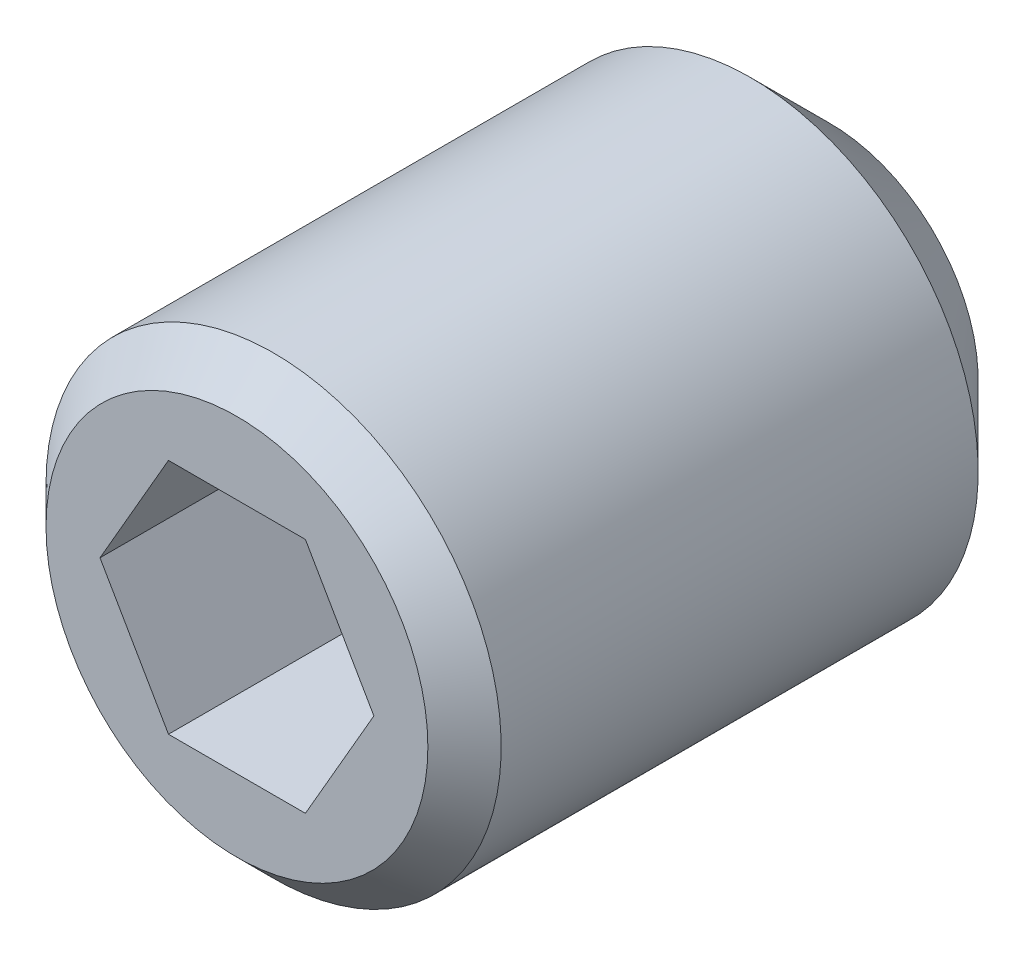
ISO-10303-21;
HEADER;
FILE_DESCRIPTION(('STEP AP214'),'2;1');
FILE_NAME('part.step','',(''),(''),'','','');
FILE_SCHEMA(('AUTOMOTIVE_DESIGN { 1 0 10303 214 1 1 1 1 }'));
ENDSEC;
DATA;
#1=APPLICATION_CONTEXT('core data for automotive mechanical design processes');
#2=APPLICATION_PROTOCOL_DEFINITION('international standard','automotive_design',2000,#1);
#3=PRODUCT_CONTEXT('',#1,'mechanical');
#4=PRODUCT('Part','Part','',(#3));
#5=PRODUCT_RELATED_PRODUCT_CATEGORY('part','',(#4));
#6=PRODUCT_DEFINITION_FORMATION('','',#4);
#7=PRODUCT_DEFINITION_CONTEXT('part definition',#1,'design');
#8=PRODUCT_DEFINITION('design','',#6,#7);
#9=PRODUCT_DEFINITION_SHAPE('','',#8);
#10=(LENGTH_UNIT() NAMED_UNIT(*) SI_UNIT(.MILLI.,.METRE.));
#11=(NAMED_UNIT(*) PLANE_ANGLE_UNIT() SI_UNIT($,.RADIAN.));
#12=(NAMED_UNIT(*) SI_UNIT($,.STERADIAN.) SOLID_ANGLE_UNIT());
#13=UNCERTAINTY_MEASURE_WITH_UNIT(LENGTH_MEASURE(1.E-05),#10,'distance_accuracy_value','');
#14=(GEOMETRIC_REPRESENTATION_CONTEXT(3) GLOBAL_UNCERTAINTY_ASSIGNED_CONTEXT((#13)) GLOBAL_UNIT_ASSIGNED_CONTEXT((#10,
#11,#12)) REPRESENTATION_CONTEXT('',''));
#15=CARTESIAN_POINT('',(0.,0.,0.));
#16=DIRECTION('',(0.,0.,1.));
#17=DIRECTION('',(1.,0.,0.));
#18=AXIS2_PLACEMENT_3D('',#15,#16,#17);
#19=CARTESIAN_POINT('',(0.,0.,0.));
#20=DIRECTION('',(0.,0.,-1.));
#21=DIRECTION('',(-1.,0.,0.));
#22=AXIS2_PLACEMENT_3D('',#19,#20,#21);
#23=PLANE('',#22);
#24=CARTESIAN_POINT('',(0.,0.,0.));
#25=DIRECTION('',(0.,0.,-1.));
#26=DIRECTION('',(-1.,0.,0.));
#27=AXIS2_PLACEMENT_3D('',#24,#25,#26);
#28=CIRCLE('',#27,1.61);
#29=CARTESIAN_POINT('',(-1.61,0.,0.));
#30=VERTEX_POINT('',#29);
#31=EDGE_CURVE('E122',#30,#30,#28,.T.);
#32=ORIENTED_EDGE('',*,*,#31,.F.);
#33=EDGE_LOOP('',(#32));
#34=FACE_BOUND('',#33,.T.);
#35=DIRECTION('',(-1.,0.,0.));
#36=VECTOR('',#35,1.);
#37=CARTESIAN_POINT('',(0.577350269189626,1.,0.));
#38=LINE('',#37,#36);
#39=CARTESIAN_POINT('',(0.577350269189626,1.,0.));
#40=VERTEX_POINT('',#39);
#41=CARTESIAN_POINT('',(-0.577350269189626,1.,0.));
#42=VERTEX_POINT('',#41);
#43=EDGE_CURVE('E104',#40,#42,#38,.T.);
#44=ORIENTED_EDGE('',*,*,#43,.F.);
#45=DIRECTION('',(-0.5,0.866025403784439,0.));
#46=VECTOR('',#45,1.);
#47=CARTESIAN_POINT('',(1.15470053837925,0.,0.));
#48=LINE('',#47,#46);
#49=CARTESIAN_POINT('',(1.15470053837925,0.,0.));
#50=VERTEX_POINT('',#49);
#51=EDGE_CURVE('E114',#50,#40,#48,.T.);
#52=ORIENTED_EDGE('',*,*,#51,.F.);
#53=DIRECTION('',(0.5,0.866025403784439,0.));
#54=VECTOR('',#53,1.);
#55=CARTESIAN_POINT('',(0.577350269189626,-1.,0.));
#56=LINE('',#55,#54);
#57=CARTESIAN_POINT('',(0.577350269189626,-1.,0.));
#58=VERTEX_POINT('',#57);
#59=EDGE_CURVE('E32',#58,#50,#56,.T.);
#60=ORIENTED_EDGE('',*,*,#59,.F.);
#61=DIRECTION('',(1.,0.,0.));
#62=VECTOR('',#61,1.);
#63=CARTESIAN_POINT('',(-0.577350269189626,-1.,0.));
#64=LINE('',#63,#62);
#65=CARTESIAN_POINT('',(-0.577350269189625,-1.,0.));
#66=VERTEX_POINT('',#65);
#67=EDGE_CURVE('E111',#66,#58,#64,.T.);
#68=ORIENTED_EDGE('',*,*,#67,.F.);
#69=DIRECTION('',(0.5,-0.866025403784438,0.));
#70=VECTOR('',#69,1.);
#71=CARTESIAN_POINT('',(-1.15470053837925,0.,0.));
#72=LINE('',#71,#70);
#73=CARTESIAN_POINT('',(-1.15470053837925,0.,0.));
#74=VERTEX_POINT('',#73);
#75=EDGE_CURVE('E81',#74,#66,#72,.T.);
#76=ORIENTED_EDGE('',*,*,#75,.F.);
#77=DIRECTION('',(-0.5,-0.866025403784439,0.));
#78=VECTOR('',#77,1.);
#79=CARTESIAN_POINT('',(-0.577350269189626,1.,0.));
#80=LINE('',#79,#78);
#81=EDGE_CURVE('E107',#42,#74,#80,.T.);
#82=ORIENTED_EDGE('',*,*,#81,.F.);
#83=EDGE_LOOP('',(#44,#52,#60,#68,#76,#82));
#84=FACE_BOUND('',#83,.T.);
#85=ADVANCED_FACE('F17',(#34,#84),#23,.F.);
#86=CARTESIAN_POINT('',(0.,0.,0.));
#87=DIRECTION('',(0.,0.,-1.));
#88=DIRECTION('',(-1.,0.,0.));
#89=AXIS2_PLACEMENT_3D('',#86,#87,#88);
#90=CONICAL_SURFACE('',#89,1.61,0.785398163397452);
#91=CARTESIAN_POINT('',(0.,0.,-0.309));
#92=DIRECTION('',(0.,0.,-1.));
#93=DIRECTION('',(-1.,0.,0.));
#94=AXIS2_PLACEMENT_3D('',#91,#92,#93);
#95=CIRCLE('',#94,1.919);
#96=CARTESIAN_POINT('',(-1.919,0.,-0.309));
#97=VERTEX_POINT('',#96);
#98=EDGE_CURVE('E11',#97,#97,#95,.T.);
#99=ORIENTED_EDGE('',*,*,#98,.F.);
#100=EDGE_LOOP('',(#99));
#101=FACE_BOUND('',#100,.T.);
#102=ORIENTED_EDGE('',*,*,#31,.T.);
#103=EDGE_LOOP('',(#102));
#104=FACE_BOUND('',#103,.T.);
#105=ADVANCED_FACE('F19',(#101,#104),#90,.T.);
#106=CARTESIAN_POINT('',(0.,0.,0.));
#107=DIRECTION('',(0.,0.,-1.));
#108=DIRECTION('',(-1.,0.,0.));
#109=AXIS2_PLACEMENT_3D('',#106,#107,#108);
#110=CYLINDRICAL_SURFACE('',#109,1.919);
#111=CARTESIAN_POINT('',(0.,0.,-4.331));
#112=DIRECTION('',(0.,0.,-1.));
#113=DIRECTION('',(-1.,0.,0.));
#114=AXIS2_PLACEMENT_3D('',#111,#112,#113);
#115=CIRCLE('',#114,1.919);
#116=CARTESIAN_POINT('',(-1.919,0.,-4.331));
#117=VERTEX_POINT('',#116);
#118=EDGE_CURVE('E25',#117,#117,#115,.T.);
#119=ORIENTED_EDGE('',*,*,#118,.F.);
#120=EDGE_LOOP('',(#119));
#121=FACE_BOUND('',#120,.T.);
#122=ORIENTED_EDGE('',*,*,#98,.T.);
#123=EDGE_LOOP('',(#122));
#124=FACE_BOUND('',#123,.T.);
#125=ADVANCED_FACE('F133',(#121,#124),#110,.T.);
#126=CARTESIAN_POINT('',(0.,0.,-4.331));
#127=DIRECTION('',(0.,0.,1.));
#128=DIRECTION('',(1.,0.,0.));
#129=AXIS2_PLACEMENT_3D('',#126,#127,#128);
#130=CONICAL_SURFACE('',#129,1.919,0.785398163397448);
#131=CARTESIAN_POINT('',(0.,0.,-5.));
#132=DIRECTION('',(0.,0.,-1.));
#133=DIRECTION('',(-1.,0.,0.));
#134=AXIS2_PLACEMENT_3D('',#131,#132,#133);
#135=CIRCLE('',#134,1.25);
#136=CARTESIAN_POINT('',(-1.25,0.,-5.));
#137=VERTEX_POINT('',#136);
#138=EDGE_CURVE('E126',#137,#137,#135,.T.);
#139=ORIENTED_EDGE('',*,*,#138,.F.);
#140=EDGE_LOOP('',(#139));
#141=FACE_BOUND('',#140,.T.);
#142=ORIENTED_EDGE('',*,*,#118,.T.);
#143=EDGE_LOOP('',(#142));
#144=FACE_BOUND('',#143,.T.);
#145=ADVANCED_FACE('F131',(#141,#144),#130,.T.);
#146=CARTESIAN_POINT('',(0.,1.25,-5.));
#147=DIRECTION('',(0.,0.,1.));
#148=DIRECTION('',(1.,0.,0.));
#149=AXIS2_PLACEMENT_3D('',#146,#147,#148);
#150=PLANE('',#149);
#151=ORIENTED_EDGE('',*,*,#138,.T.);
#152=EDGE_LOOP('',(#151));
#153=FACE_BOUND('',#152,.T.);
#154=ADVANCED_FACE('F171',(#153),#150,.F.);
#155=CARTESIAN_POINT('',(0.577350269189626,1.,-2.5));
#156=DIRECTION('',(0.,1.,0.));
#157=DIRECTION('',(0.,0.,1.));
#158=AXIS2_PLACEMENT_3D('',#155,#156,#157);
#159=PLANE('',#158);
#160=ORIENTED_EDGE('',*,*,#43,.T.);
#161=DIRECTION('',(0.,0.,1.));
#162=VECTOR('',#161,1.);
#163=CARTESIAN_POINT('',(-0.577350269189626,1.,-2.5));
#164=LINE('',#163,#162);
#165=CARTESIAN_POINT('',(-0.577350269189626,1.,-2.5));
#166=VERTEX_POINT('',#165);
#167=EDGE_CURVE('E120',#166,#42,#164,.T.);
#168=ORIENTED_EDGE('',*,*,#167,.F.);
#169=DIRECTION('',(-1.,0.,0.));
#170=VECTOR('',#169,1.);
#171=CARTESIAN_POINT('',(0.577350269189626,1.,-2.5));
#172=LINE('',#171,#170);
#173=CARTESIAN_POINT('',(0.577350269189626,1.,-2.5));
#174=VERTEX_POINT('',#173);
#175=EDGE_CURVE('E116',#174,#166,#172,.T.);
#176=ORIENTED_EDGE('',*,*,#175,.F.);
#177=DIRECTION('',(0.,0.,1.));
#178=VECTOR('',#177,1.);
#179=CARTESIAN_POINT('',(0.577350269189626,1.,-2.5));
#180=LINE('',#179,#178);
#181=EDGE_CURVE('E65',#174,#40,#180,.T.);
#182=ORIENTED_EDGE('',*,*,#181,.T.);
#183=EDGE_LOOP('',(#160,#168,#176,#182));
#184=FACE_BOUND('',#183,.T.);
#185=ADVANCED_FACE('F149',(#184),#159,.F.);
#186=CARTESIAN_POINT('',(-0.577350269189626,1.,-2.5));
#187=DIRECTION('',(-0.866025403784439,0.5,0.));
#188=DIRECTION('',(-0.5,-0.866025403784439,0.));
#189=AXIS2_PLACEMENT_3D('',#186,#187,#188);
#190=PLANE('',#189);
#191=ORIENTED_EDGE('',*,*,#81,.T.);
#192=DIRECTION('',(0.,0.,1.));
#193=VECTOR('',#192,1.);
#194=CARTESIAN_POINT('',(-1.15470053837925,0.,-2.5));
#195=LINE('',#194,#193);
#196=CARTESIAN_POINT('',(-1.15470053837925,0.,-2.5));
#197=VERTEX_POINT('',#196);
#198=EDGE_CURVE('E85',#197,#74,#195,.T.);
#199=ORIENTED_EDGE('',*,*,#198,.F.);
#200=DIRECTION('',(-0.5,-0.866025403784439,0.));
#201=VECTOR('',#200,1.);
#202=CARTESIAN_POINT('',(-0.577350269189626,1.,-2.5));
#203=LINE('',#202,#201);
#204=EDGE_CURVE('E94',#166,#197,#203,.T.);
#205=ORIENTED_EDGE('',*,*,#204,.F.);
#206=ORIENTED_EDGE('',*,*,#167,.T.);
#207=EDGE_LOOP('',(#191,#199,#205,#206));
#208=FACE_BOUND('',#207,.T.);
#209=ADVANCED_FACE('F166',(#208),#190,.F.);
#210=CARTESIAN_POINT('',(-1.15470053837925,0.,-2.5));
#211=DIRECTION('',(-0.866025403784438,-0.5,0.));
#212=DIRECTION('',(0.5,-0.866025403784438,0.));
#213=AXIS2_PLACEMENT_3D('',#210,#211,#212);
#214=PLANE('',#213);
#215=ORIENTED_EDGE('',*,*,#75,.T.);
#216=DIRECTION('',(0.,0.,1.));
#217=VECTOR('',#216,1.);
#218=CARTESIAN_POINT('',(-0.577350269189625,-1.,-2.5));
#219=LINE('',#218,#217);
#220=CARTESIAN_POINT('',(-0.577350269189625,-1.,-2.5));
#221=VERTEX_POINT('',#220);
#222=EDGE_CURVE('E76',#221,#66,#219,.T.);
#223=ORIENTED_EDGE('',*,*,#222,.F.);
#224=DIRECTION('',(0.5,-0.866025403784438,0.));
#225=VECTOR('',#224,1.);
#226=CARTESIAN_POINT('',(-1.15470053837925,0.,-2.5));
#227=LINE('',#226,#225);
#228=EDGE_CURVE('E79',#197,#221,#227,.T.);
#229=ORIENTED_EDGE('',*,*,#228,.F.);
#230=ORIENTED_EDGE('',*,*,#198,.T.);
#231=EDGE_LOOP('',(#215,#223,#229,#230));
#232=FACE_BOUND('',#231,.T.);
#233=ADVANCED_FACE('F78',(#232),#214,.F.);
#234=CARTESIAN_POINT('',(-0.577350269189626,-1.,-2.5));
#235=DIRECTION('',(0.,-1.,0.));
#236=DIRECTION('',(1.,0.,0.));
#237=AXIS2_PLACEMENT_3D('',#234,#235,#236);
#238=PLANE('',#237);
#239=ORIENTED_EDGE('',*,*,#67,.T.);
#240=DIRECTION('',(0.,0.,1.));
#241=VECTOR('',#240,1.);
#242=CARTESIAN_POINT('',(0.577350269189626,-1.,-2.5));
#243=LINE('',#242,#241);
#244=CARTESIAN_POINT('',(0.577350269189626,-1.,-2.5));
#245=VERTEX_POINT('',#244);
#246=EDGE_CURVE('E57',#245,#58,#243,.T.);
#247=ORIENTED_EDGE('',*,*,#246,.F.);
#248=DIRECTION('',(1.,0.,0.));
#249=VECTOR('',#248,1.);
#250=CARTESIAN_POINT('',(-0.577350269189626,-1.,-2.5));
#251=LINE('',#250,#249);
#252=EDGE_CURVE('E92',#221,#245,#251,.T.);
#253=ORIENTED_EDGE('',*,*,#252,.F.);
#254=ORIENTED_EDGE('',*,*,#222,.T.);
#255=EDGE_LOOP('',(#239,#247,#253,#254));
#256=FACE_BOUND('',#255,.T.);
#257=ADVANCED_FACE('F96',(#256),#238,.F.);
#258=CARTESIAN_POINT('',(0.577350269189626,-1.,-2.5));
#259=DIRECTION('',(0.866025403784439,-0.5,0.));
#260=DIRECTION('',(0.5,0.866025403784439,0.));
#261=AXIS2_PLACEMENT_3D('',#258,#259,#260);
#262=PLANE('',#261);
#263=ORIENTED_EDGE('',*,*,#59,.T.);
#264=DIRECTION('',(0.,0.,1.));
#265=VECTOR('',#264,1.);
#266=CARTESIAN_POINT('',(1.15470053837925,0.,-2.5));
#267=LINE('',#266,#265);
#268=CARTESIAN_POINT('',(1.15470053837925,0.,-2.5));
#269=VERTEX_POINT('',#268);
#270=EDGE_CURVE('E37',#269,#50,#267,.T.);
#271=ORIENTED_EDGE('',*,*,#270,.F.);
#272=DIRECTION('',(0.5,0.866025403784439,0.));
#273=VECTOR('',#272,1.);
#274=CARTESIAN_POINT('',(0.577350269189626,-1.,-2.5));
#275=LINE('',#274,#273);
#276=EDGE_CURVE('E97',#245,#269,#275,.T.);
#277=ORIENTED_EDGE('',*,*,#276,.F.);
#278=ORIENTED_EDGE('',*,*,#246,.T.);
#279=EDGE_LOOP('',(#263,#271,#277,#278));
#280=FACE_BOUND('',#279,.T.);
#281=ADVANCED_FACE('F152',(#280),#262,.F.);
#282=CARTESIAN_POINT('',(1.15470053837925,0.,-2.5));
#283=DIRECTION('',(0.866025403784439,0.5,0.));
#284=DIRECTION('',(-0.5,0.866025403784439,0.));
#285=AXIS2_PLACEMENT_3D('',#282,#283,#284);
#286=PLANE('',#285);
#287=ORIENTED_EDGE('',*,*,#51,.T.);
#288=ORIENTED_EDGE('',*,*,#181,.F.);
#289=DIRECTION('',(-0.5,0.866025403784439,0.));
#290=VECTOR('',#289,1.);
#291=CARTESIAN_POINT('',(1.15470053837925,0.,-2.5));
#292=LINE('',#291,#290);
#293=EDGE_CURVE('E99',#269,#174,#292,.T.);
#294=ORIENTED_EDGE('',*,*,#293,.F.);
#295=ORIENTED_EDGE('',*,*,#270,.T.);
#296=EDGE_LOOP('',(#287,#288,#294,#295));
#297=FACE_BOUND('',#296,.T.);
#298=ADVANCED_FACE('F151',(#297),#286,.F.);
#299=CARTESIAN_POINT('',(1.73205080756888,1.,-2.5));
#300=DIRECTION('',(0.,0.,-1.));
#301=DIRECTION('',(-1.,0.,0.));
#302=AXIS2_PLACEMENT_3D('',#299,#300,#301);
#303=PLANE('',#302);
#304=ORIENTED_EDGE('',*,*,#175,.T.);
#305=ORIENTED_EDGE('',*,*,#204,.T.);
#306=ORIENTED_EDGE('',*,*,#228,.T.);
#307=ORIENTED_EDGE('',*,*,#252,.T.);
#308=ORIENTED_EDGE('',*,*,#276,.T.);
#309=ORIENTED_EDGE('',*,*,#293,.T.);
#310=EDGE_LOOP('',(#304,#305,#306,#307,#308,#309));
#311=FACE_BOUND('',#310,.T.);
#312=ADVANCED_FACE('F91',(#311),#303,.F.);
#313=CLOSED_SHELL('',(#85,#105,#125,#145,#154,#185,#209,#233,#257,#281,#298,#312));
#314=MANIFOLD_SOLID_BREP('B1',#313);
#315=ADVANCED_BREP_SHAPE_REPRESENTATION('',(#18,#314),#14);
#316=SHAPE_DEFINITION_REPRESENTATION(#9,#315);
ENDSEC;
END-ISO-10303-21;
